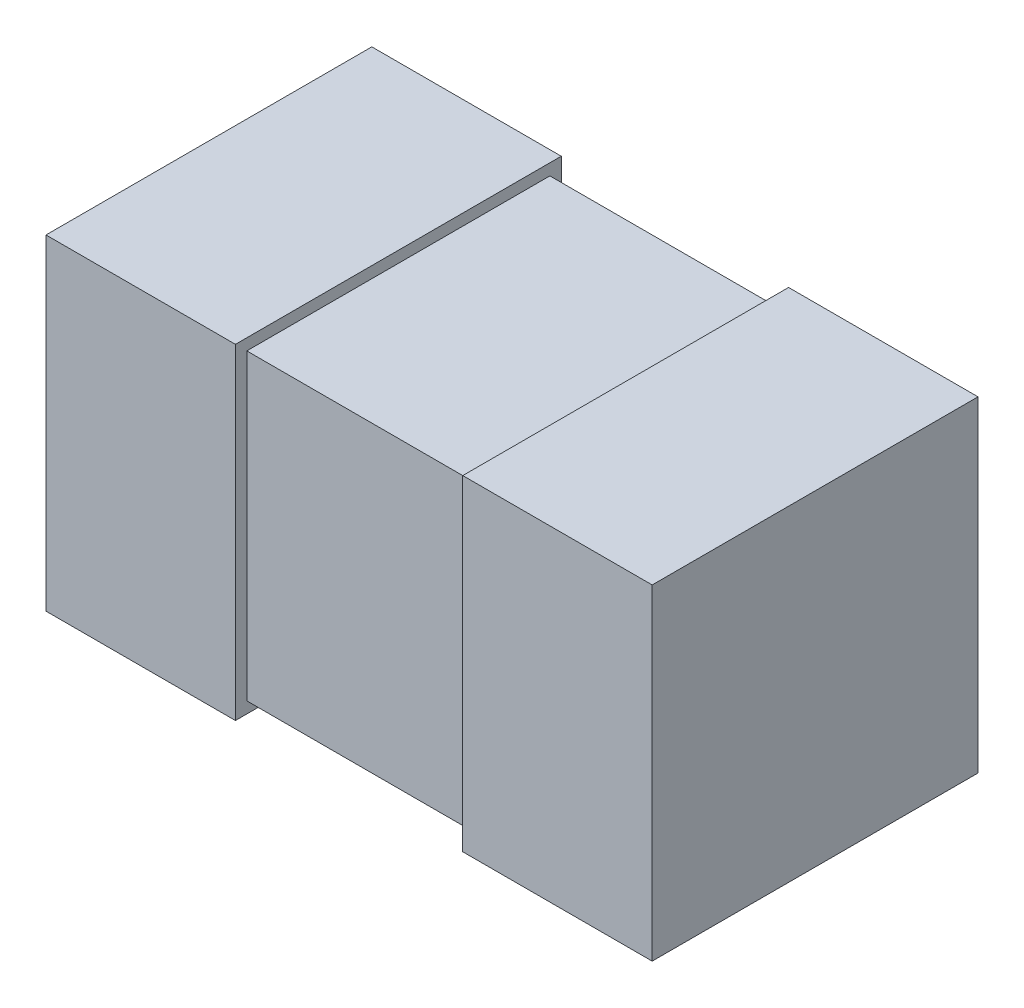
ISO-10303-21;
HEADER;
FILE_DESCRIPTION(('STEP AP214'),'2;1');
FILE_NAME('part.step','',(''),(''),'','','');
FILE_SCHEMA(('AUTOMOTIVE_DESIGN { 1 0 10303 214 1 1 1 1 }'));
ENDSEC;
DATA;
#1=APPLICATION_CONTEXT('core data for automotive mechanical design processes');
#2=APPLICATION_PROTOCOL_DEFINITION('international standard','automotive_design',2000,#1);
#3=PRODUCT_CONTEXT('',#1,'mechanical');
#4=PRODUCT('Part','Part','',(#3));
#5=PRODUCT_RELATED_PRODUCT_CATEGORY('part','',(#4));
#6=PRODUCT_DEFINITION_FORMATION('','',#4);
#7=PRODUCT_DEFINITION_CONTEXT('part definition',#1,'design');
#8=PRODUCT_DEFINITION('design','',#6,#7);
#9=PRODUCT_DEFINITION_SHAPE('','',#8);
#10=(LENGTH_UNIT() NAMED_UNIT(*) SI_UNIT(.MILLI.,.METRE.));
#11=(NAMED_UNIT(*) PLANE_ANGLE_UNIT() SI_UNIT($,.RADIAN.));
#12=(NAMED_UNIT(*) SI_UNIT($,.STERADIAN.) SOLID_ANGLE_UNIT());
#13=UNCERTAINTY_MEASURE_WITH_UNIT(LENGTH_MEASURE(1.E-05),#10,'distance_accuracy_value','');
#14=(GEOMETRIC_REPRESENTATION_CONTEXT(3) GLOBAL_UNCERTAINTY_ASSIGNED_CONTEXT((#13)) GLOBAL_UNIT_ASSIGNED_CONTEXT((#10,
#11,#12)) REPRESENTATION_CONTEXT('',''));
#15=CARTESIAN_POINT('',(0.,0.,0.));
#16=DIRECTION('',(0.,0.,1.));
#17=DIRECTION('',(1.,0.,0.));
#18=AXIS2_PLACEMENT_3D('',#15,#16,#17);
#19=CARTESIAN_POINT('',(-0.8,0.8,0.4));
#20=DIRECTION('',(0.,0.,-1.));
#21=DIRECTION('',(-1.,0.,0.));
#22=AXIS2_PLACEMENT_3D('',#19,#20,#21);
#23=PLANE('',#22);
#24=DIRECTION('',(0.,-1.,0.));
#25=VECTOR('',#24,1.);
#26=CARTESIAN_POINT('',(0.299999999999999,0.8,0.4));
#27=LINE('',#26,#25);
#28=CARTESIAN_POINT('',(0.299999999999999,0.8,0.4));
#29=VERTEX_POINT('',#28);
#30=CARTESIAN_POINT('',(0.299999999999999,0.,0.4));
#31=VERTEX_POINT('',#30);
#32=EDGE_CURVE('E32',#29,#31,#27,.T.);
#33=ORIENTED_EDGE('',*,*,#32,.F.);
#34=DIRECTION('',(1.,0.,0.));
#35=VECTOR('',#34,1.);
#36=CARTESIAN_POINT('',(-0.8,0.8,0.4));
#37=LINE('',#36,#35);
#38=CARTESIAN_POINT('',(-0.3,0.8,0.4));
#39=VERTEX_POINT('',#38);
#40=EDGE_CURVE('E197',#39,#29,#37,.T.);
#41=ORIENTED_EDGE('',*,*,#40,.F.);
#42=DIRECTION('',(0.,1.,0.));
#43=VECTOR('',#42,1.);
#44=CARTESIAN_POINT('',(-0.3,0.8,0.4));
#45=LINE('',#44,#43);
#46=CARTESIAN_POINT('',(-0.3,0.,0.4));
#47=VERTEX_POINT('',#46);
#48=EDGE_CURVE('E191',#47,#39,#45,.T.);
#49=ORIENTED_EDGE('',*,*,#48,.F.);
#50=DIRECTION('',(1.,0.,0.));
#51=VECTOR('',#50,1.);
#52=CARTESIAN_POINT('',(-0.8,0.,0.4));
#53=LINE('',#52,#51);
#54=EDGE_CURVE('E196',#47,#31,#53,.T.);
#55=ORIENTED_EDGE('',*,*,#54,.T.);
#56=EDGE_LOOP('',(#33,#41,#49,#55));
#57=FACE_BOUND('',#56,.T.);
#58=ADVANCED_FACE('F17',(#57),#23,.F.);
#59=CARTESIAN_POINT('',(-0.8,0.8,-0.4));
#60=DIRECTION('',(0.,0.,1.));
#61=DIRECTION('',(1.,0.,0.));
#62=AXIS2_PLACEMENT_3D('',#59,#60,#61);
#63=PLANE('',#62);
#64=DIRECTION('',(0.,1.,0.));
#65=VECTOR('',#64,1.);
#66=CARTESIAN_POINT('',(0.3,0.8,-0.4));
#67=LINE('',#66,#65);
#68=CARTESIAN_POINT('',(0.3,0.,-0.4));
#69=VERTEX_POINT('',#68);
#70=CARTESIAN_POINT('',(0.3,0.8,-0.4));
#71=VERTEX_POINT('',#70);
#72=EDGE_CURVE('E146',#69,#71,#67,.T.);
#73=ORIENTED_EDGE('',*,*,#72,.F.);
#74=DIRECTION('',(-1.,0.,0.));
#75=VECTOR('',#74,1.);
#76=CARTESIAN_POINT('',(-0.8,0.,-0.4));
#77=LINE('',#76,#75);
#78=CARTESIAN_POINT('',(-0.3,0.,-0.4));
#79=VERTEX_POINT('',#78);
#80=EDGE_CURVE('E200',#69,#79,#77,.T.);
#81=ORIENTED_EDGE('',*,*,#80,.T.);
#82=DIRECTION('',(0.,-1.,0.));
#83=VECTOR('',#82,1.);
#84=CARTESIAN_POINT('',(-0.3,0.8,-0.4));
#85=LINE('',#84,#83);
#86=CARTESIAN_POINT('',(-0.3,0.8,-0.4));
#87=VERTEX_POINT('',#86);
#88=EDGE_CURVE('E179',#87,#79,#85,.T.);
#89=ORIENTED_EDGE('',*,*,#88,.F.);
#90=DIRECTION('',(-1.,0.,0.));
#91=VECTOR('',#90,1.);
#92=CARTESIAN_POINT('',(-0.8,0.8,-0.4));
#93=LINE('',#92,#91);
#94=EDGE_CURVE('E199',#71,#87,#93,.T.);
#95=ORIENTED_EDGE('',*,*,#94,.F.);
#96=EDGE_LOOP('',(#73,#81,#89,#95));
#97=FACE_BOUND('',#96,.T.);
#98=ADVANCED_FACE('F217',(#97),#63,.F.);
#99=CARTESIAN_POINT('',(-0.8,0.8,0.4));
#100=DIRECTION('',(0.,1.,0.));
#101=DIRECTION('',(0.,0.,1.));
#102=AXIS2_PLACEMENT_3D('',#99,#100,#101);
#103=PLANE('',#102);
#104=ORIENTED_EDGE('',*,*,#40,.T.);
#105=DIRECTION('',(0.,0.,-1.));
#106=VECTOR('',#105,1.);
#107=CARTESIAN_POINT('',(0.3,0.8,0.4));
#108=LINE('',#107,#106);
#109=EDGE_CURVE('E39',#29,#71,#108,.T.);
#110=ORIENTED_EDGE('',*,*,#109,.T.);
#111=ORIENTED_EDGE('',*,*,#94,.T.);
#112=DIRECTION('',(0.,0.,1.));
#113=VECTOR('',#112,1.);
#114=CARTESIAN_POINT('',(-0.3,0.8,0.4));
#115=LINE('',#114,#113);
#116=EDGE_CURVE('E194',#87,#39,#115,.T.);
#117=ORIENTED_EDGE('',*,*,#116,.T.);
#118=EDGE_LOOP('',(#104,#110,#111,#117));
#119=FACE_BOUND('',#118,.T.);
#120=ADVANCED_FACE('F214',(#119),#103,.T.);
#121=CARTESIAN_POINT('',(-0.8,0.,0.4));
#122=DIRECTION('',(0.,1.,0.));
#123=DIRECTION('',(0.,0.,1.));
#124=AXIS2_PLACEMENT_3D('',#121,#122,#123);
#125=PLANE('',#124);
#126=DIRECTION('',(0.,0.,-1.));
#127=VECTOR('',#126,1.);
#128=CARTESIAN_POINT('',(0.3,0.,0.4));
#129=LINE('',#128,#127);
#130=EDGE_CURVE('E10',#31,#69,#129,.T.);
#131=ORIENTED_EDGE('',*,*,#130,.F.);
#132=ORIENTED_EDGE('',*,*,#54,.F.);
#133=DIRECTION('',(0.,0.,1.));
#134=VECTOR('',#133,1.);
#135=CARTESIAN_POINT('',(-0.3,0.,0.4));
#136=LINE('',#135,#134);
#137=EDGE_CURVE('E25',#79,#47,#136,.T.);
#138=ORIENTED_EDGE('',*,*,#137,.F.);
#139=ORIENTED_EDGE('',*,*,#80,.F.);
#140=EDGE_LOOP('',(#131,#132,#138,#139));
#141=FACE_BOUND('',#140,.T.);
#142=ADVANCED_FACE('F212',(#141),#125,.F.);
#143=CARTESIAN_POINT('',(-0.3,-0.03,1.45478640923567));
#144=DIRECTION('',(0.,1.,0.));
#145=DIRECTION('',(-1.,0.,0.));
#146=AXIS2_PLACEMENT_3D('',#143,#144,#145);
#147=PLANE('',#146);
#148=DIRECTION('',(0.,0.,-1.));
#149=VECTOR('',#148,1.);
#150=CARTESIAN_POINT('',(-0.3,-0.03,1.45478640923567));
#151=LINE('',#150,#149);
#152=CARTESIAN_POINT('',(-0.3,-0.03,0.43));
#153=VERTEX_POINT('',#152);
#154=CARTESIAN_POINT('',(-0.3,-0.03,-0.43));
#155=VERTEX_POINT('',#154);
#156=EDGE_CURVE('E168',#153,#155,#151,.T.);
#157=ORIENTED_EDGE('',*,*,#156,.F.);
#158=DIRECTION('',(-1.,0.,0.));
#159=VECTOR('',#158,1.);
#160=CARTESIAN_POINT('',(-0.3,-0.03,0.43));
#161=LINE('',#160,#159);
#162=CARTESIAN_POINT('',(-0.8,-0.03,0.43));
#163=VERTEX_POINT('',#162);
#164=EDGE_CURVE('E173',#153,#163,#161,.T.);
#165=ORIENTED_EDGE('',*,*,#164,.T.);
#166=DIRECTION('',(0.,0.,-1.));
#167=VECTOR('',#166,1.);
#168=CARTESIAN_POINT('',(-0.8,-0.03,1.45478640923567));
#169=LINE('',#168,#167);
#170=CARTESIAN_POINT('',(-0.8,-0.03,-0.43));
#171=VERTEX_POINT('',#170);
#172=EDGE_CURVE('E181',#163,#171,#169,.T.);
#173=ORIENTED_EDGE('',*,*,#172,.T.);
#174=DIRECTION('',(-1.,0.,0.));
#175=VECTOR('',#174,1.);
#176=CARTESIAN_POINT('',(-0.3,-0.03,-0.43));
#177=LINE('',#176,#175);
#178=EDGE_CURVE('E159',#155,#171,#177,.T.);
#179=ORIENTED_EDGE('',*,*,#178,.F.);
#180=EDGE_LOOP('',(#157,#165,#173,#179));
#181=FACE_BOUND('',#180,.T.);
#182=ADVANCED_FACE('F259',(#181),#147,.F.);
#183=CARTESIAN_POINT('',(-0.3,0.83,1.45478640923567));
#184=DIRECTION('',(0.,-1.,0.));
#185=DIRECTION('',(1.,0.,0.));
#186=AXIS2_PLACEMENT_3D('',#183,#184,#185);
#187=PLANE('',#186);
#188=DIRECTION('',(0.,0.,-1.));
#189=VECTOR('',#188,1.);
#190=CARTESIAN_POINT('',(-0.8,0.83,1.45478640923567));
#191=LINE('',#190,#189);
#192=CARTESIAN_POINT('',(-0.8,0.83,0.43));
#193=VERTEX_POINT('',#192);
#194=CARTESIAN_POINT('',(-0.8,0.83,-0.43));
#195=VERTEX_POINT('',#194);
#196=EDGE_CURVE('E183',#193,#195,#191,.T.);
#197=ORIENTED_EDGE('',*,*,#196,.F.);
#198=DIRECTION('',(1.,0.,0.));
#199=VECTOR('',#198,1.);
#200=CARTESIAN_POINT('',(-0.3,0.83,0.43));
#201=LINE('',#200,#199);
#202=CARTESIAN_POINT('',(-0.3,0.83,0.43));
#203=VERTEX_POINT('',#202);
#204=EDGE_CURVE('E172',#193,#203,#201,.T.);
#205=ORIENTED_EDGE('',*,*,#204,.T.);
#206=DIRECTION('',(0.,0.,-1.));
#207=VECTOR('',#206,1.);
#208=CARTESIAN_POINT('',(-0.3,0.83,1.45478640923567));
#209=LINE('',#208,#207);
#210=CARTESIAN_POINT('',(-0.3,0.83,-0.43));
#211=VERTEX_POINT('',#210);
#212=EDGE_CURVE('E185',#203,#211,#209,.T.);
#213=ORIENTED_EDGE('',*,*,#212,.T.);
#214=DIRECTION('',(1.,0.,0.));
#215=VECTOR('',#214,1.);
#216=CARTESIAN_POINT('',(-0.3,0.83,-0.43));
#217=LINE('',#216,#215);
#218=EDGE_CURVE('E165',#195,#211,#217,.T.);
#219=ORIENTED_EDGE('',*,*,#218,.F.);
#220=EDGE_LOOP('',(#197,#205,#213,#219));
#221=FACE_BOUND('',#220,.T.);
#222=ADVANCED_FACE('F262',(#221),#187,.F.);
#223=CARTESIAN_POINT('',(-0.3,0.83,1.45478640923567));
#224=DIRECTION('',(-1.,0.,0.));
#225=DIRECTION('',(0.,-1.,0.));
#226=AXIS2_PLACEMENT_3D('',#223,#224,#225);
#227=PLANE('',#226);
#228=ORIENTED_EDGE('',*,*,#116,.F.);
#229=ORIENTED_EDGE('',*,*,#88,.T.);
#230=ORIENTED_EDGE('',*,*,#137,.T.);
#231=ORIENTED_EDGE('',*,*,#48,.T.);
#232=EDGE_LOOP('',(#228,#229,#230,#231));
#233=FACE_BOUND('',#232,.T.);
#234=ORIENTED_EDGE('',*,*,#212,.F.);
#235=DIRECTION('',(0.,-1.,0.));
#236=VECTOR('',#235,1.);
#237=CARTESIAN_POINT('',(-0.3,0.83,0.43));
#238=LINE('',#237,#236);
#239=EDGE_CURVE('E176',#203,#153,#238,.T.);
#240=ORIENTED_EDGE('',*,*,#239,.T.);
#241=ORIENTED_EDGE('',*,*,#156,.T.);
#242=DIRECTION('',(0.,-1.,0.));
#243=VECTOR('',#242,1.);
#244=CARTESIAN_POINT('',(-0.3,0.83,-0.43));
#245=LINE('',#244,#243);
#246=EDGE_CURVE('E162',#211,#155,#245,.T.);
#247=ORIENTED_EDGE('',*,*,#246,.F.);
#248=EDGE_LOOP('',(#234,#240,#241,#247));
#249=FACE_BOUND('',#248,.T.);
#250=ADVANCED_FACE('F207',(#233,#249),#227,.F.);
#251=CARTESIAN_POINT('',(-0.8,0.8,0.43));
#252=DIRECTION('',(0.,0.,-1.));
#253=DIRECTION('',(-1.,0.,0.));
#254=AXIS2_PLACEMENT_3D('',#251,#252,#253);
#255=PLANE('',#254);
#256=ORIENTED_EDGE('',*,*,#204,.F.);
#257=DIRECTION('',(0.,1.,0.));
#258=VECTOR('',#257,1.);
#259=CARTESIAN_POINT('',(-0.8,0.83,0.43));
#260=LINE('',#259,#258);
#261=EDGE_CURVE('E169',#163,#193,#260,.T.);
#262=ORIENTED_EDGE('',*,*,#261,.F.);
#263=ORIENTED_EDGE('',*,*,#164,.F.);
#264=ORIENTED_EDGE('',*,*,#239,.F.);
#265=EDGE_LOOP('',(#256,#262,#263,#264));
#266=FACE_BOUND('',#265,.T.);
#267=ADVANCED_FACE('F254',(#266),#255,.F.);
#268=CARTESIAN_POINT('',(-0.8,0.8,-0.43));
#269=DIRECTION('',(0.,0.,1.));
#270=DIRECTION('',(1.,0.,0.));
#271=AXIS2_PLACEMENT_3D('',#268,#269,#270);
#272=PLANE('',#271);
#273=ORIENTED_EDGE('',*,*,#246,.T.);
#274=ORIENTED_EDGE('',*,*,#178,.T.);
#275=DIRECTION('',(0.,1.,0.));
#276=VECTOR('',#275,1.);
#277=CARTESIAN_POINT('',(-0.8,0.83,-0.43));
#278=LINE('',#277,#276);
#279=EDGE_CURVE('E156',#171,#195,#278,.T.);
#280=ORIENTED_EDGE('',*,*,#279,.T.);
#281=ORIENTED_EDGE('',*,*,#218,.T.);
#282=EDGE_LOOP('',(#273,#274,#280,#281));
#283=FACE_BOUND('',#282,.T.);
#284=ADVANCED_FACE('F251',(#283),#272,.F.);
#285=CARTESIAN_POINT('',(-0.8,0.8,-0.4));
#286=DIRECTION('',(1.,0.,0.));
#287=DIRECTION('',(0.,0.,-1.));
#288=AXIS2_PLACEMENT_3D('',#285,#286,#287);
#289=PLANE('',#288);
#290=ORIENTED_EDGE('',*,*,#172,.F.);
#291=ORIENTED_EDGE('',*,*,#261,.T.);
#292=ORIENTED_EDGE('',*,*,#196,.T.);
#293=ORIENTED_EDGE('',*,*,#279,.F.);
#294=EDGE_LOOP('',(#290,#291,#292,#293));
#295=FACE_BOUND('',#294,.T.);
#296=ADVANCED_FACE('F19',(#295),#289,.F.);
#297=CARTESIAN_POINT('',(0.3,-0.0299999999999999,1.45478640923567));
#298=DIRECTION('',(0.,1.,0.));
#299=DIRECTION('',(-1.,0.,0.));
#300=AXIS2_PLACEMENT_3D('',#297,#298,#299);
#301=PLANE('',#300);
#302=DIRECTION('',(0.,0.,-1.));
#303=VECTOR('',#302,1.);
#304=CARTESIAN_POINT('',(0.8,-0.0299999999999998,1.45478640923567));
#305=LINE('',#304,#303);
#306=CARTESIAN_POINT('',(0.8,-0.0299999999999998,0.43));
#307=VERTEX_POINT('',#306);
#308=CARTESIAN_POINT('',(0.8,-0.0299999999999998,-0.43));
#309=VERTEX_POINT('',#308);
#310=EDGE_CURVE('E119',#307,#309,#305,.T.);
#311=ORIENTED_EDGE('',*,*,#310,.F.);
#312=DIRECTION('',(-1.,0.,0.));
#313=VECTOR('',#312,1.);
#314=CARTESIAN_POINT('',(0.3,-0.0299999999999999,0.43));
#315=LINE('',#314,#313);
#316=CARTESIAN_POINT('',(0.3,-0.0299999999999999,0.43));
#317=VERTEX_POINT('',#316);
#318=EDGE_CURVE('E114',#307,#317,#315,.T.);
#319=ORIENTED_EDGE('',*,*,#318,.T.);
#320=DIRECTION('',(0.,0.,-1.));
#321=VECTOR('',#320,1.);
#322=CARTESIAN_POINT('',(0.3,-0.0299999999999999,1.45478640923567));
#323=LINE('',#322,#321);
#324=CARTESIAN_POINT('',(0.3,-0.0299999999999999,-0.43));
#325=VERTEX_POINT('',#324);
#326=EDGE_CURVE('E109',#317,#325,#323,.T.);
#327=ORIENTED_EDGE('',*,*,#326,.T.);
#328=DIRECTION('',(-1.,0.,0.));
#329=VECTOR('',#328,1.);
#330=CARTESIAN_POINT('',(0.3,-0.0299999999999999,-0.43));
#331=LINE('',#330,#329);
#332=EDGE_CURVE('E113',#309,#325,#331,.T.);
#333=ORIENTED_EDGE('',*,*,#332,.F.);
#334=EDGE_LOOP('',(#311,#319,#327,#333));
#335=FACE_BOUND('',#334,.T.);
#336=ADVANCED_FACE('F112',(#335),#301,.F.);
#337=CARTESIAN_POINT('',(0.3,0.83,1.45478640923567));
#338=DIRECTION('',(1.,0.,0.));
#339=DIRECTION('',(0.,0.,-1.));
#340=AXIS2_PLACEMENT_3D('',#337,#338,#339);
#341=PLANE('',#340);
#342=ORIENTED_EDGE('',*,*,#109,.F.);
#343=ORIENTED_EDGE('',*,*,#32,.T.);
#344=ORIENTED_EDGE('',*,*,#130,.T.);
#345=ORIENTED_EDGE('',*,*,#72,.T.);
#346=EDGE_LOOP('',(#342,#343,#344,#345));
#347=FACE_BOUND('',#346,.T.);
#348=ORIENTED_EDGE('',*,*,#326,.F.);
#349=DIRECTION('',(0.,1.,0.));
#350=VECTOR('',#349,1.);
#351=CARTESIAN_POINT('',(0.3,0.83,0.43));
#352=LINE('',#351,#350);
#353=CARTESIAN_POINT('',(0.3,0.83,0.43));
#354=VERTEX_POINT('',#353);
#355=EDGE_CURVE('E141',#317,#354,#352,.T.);
#356=ORIENTED_EDGE('',*,*,#355,.T.);
#357=DIRECTION('',(0.,0.,-1.));
#358=VECTOR('',#357,1.);
#359=CARTESIAN_POINT('',(0.3,0.83,1.45478640923567));
#360=LINE('',#359,#358);
#361=CARTESIAN_POINT('',(0.3,0.83,-0.43));
#362=VERTEX_POINT('',#361);
#363=EDGE_CURVE('E118',#354,#362,#360,.T.);
#364=ORIENTED_EDGE('',*,*,#363,.T.);
#365=DIRECTION('',(0.,1.,0.));
#366=VECTOR('',#365,1.);
#367=CARTESIAN_POINT('',(0.3,0.83,-0.43));
#368=LINE('',#367,#366);
#369=EDGE_CURVE('E126',#325,#362,#368,.T.);
#370=ORIENTED_EDGE('',*,*,#369,.F.);
#371=EDGE_LOOP('',(#348,#356,#364,#370));
#372=FACE_BOUND('',#371,.T.);
#373=ADVANCED_FACE('F131',(#347,#372),#341,.F.);
#374=CARTESIAN_POINT('',(0.3,0.83,1.45478640923567));
#375=DIRECTION('',(0.,-1.,0.));
#376=DIRECTION('',(0.,0.,-1.));
#377=AXIS2_PLACEMENT_3D('',#374,#375,#376);
#378=PLANE('',#377);
#379=ORIENTED_EDGE('',*,*,#363,.F.);
#380=DIRECTION('',(1.,0.,0.));
#381=VECTOR('',#380,1.);
#382=CARTESIAN_POINT('',(0.3,0.83,0.43));
#383=LINE('',#382,#381);
#384=CARTESIAN_POINT('',(0.8,0.83,0.43));
#385=VERTEX_POINT('',#384);
#386=EDGE_CURVE('E144',#354,#385,#383,.T.);
#387=ORIENTED_EDGE('',*,*,#386,.T.);
#388=DIRECTION('',(0.,0.,-1.));
#389=VECTOR('',#388,1.);
#390=CARTESIAN_POINT('',(0.8,0.83,1.45478640923567));
#391=LINE('',#390,#389);
#392=CARTESIAN_POINT('',(0.8,0.83,-0.43));
#393=VERTEX_POINT('',#392);
#394=EDGE_CURVE('E133',#385,#393,#391,.T.);
#395=ORIENTED_EDGE('',*,*,#394,.T.);
#396=DIRECTION('',(1.,0.,0.));
#397=VECTOR('',#396,1.);
#398=CARTESIAN_POINT('',(0.3,0.83,-0.43));
#399=LINE('',#398,#397);
#400=EDGE_CURVE('E134',#362,#393,#399,.T.);
#401=ORIENTED_EDGE('',*,*,#400,.F.);
#402=EDGE_LOOP('',(#379,#387,#395,#401));
#403=FACE_BOUND('',#402,.T.);
#404=ADVANCED_FACE('F238',(#403),#378,.F.);
#405=CARTESIAN_POINT('',(-0.8,0.8,0.43));
#406=DIRECTION('',(0.,0.,-1.));
#407=DIRECTION('',(-1.,0.,0.));
#408=AXIS2_PLACEMENT_3D('',#405,#406,#407);
#409=PLANE('',#408);
#410=ORIENTED_EDGE('',*,*,#355,.F.);
#411=ORIENTED_EDGE('',*,*,#318,.F.);
#412=DIRECTION('',(0.,-1.,0.));
#413=VECTOR('',#412,1.);
#414=CARTESIAN_POINT('',(0.8,0.83,0.43));
#415=LINE('',#414,#413);
#416=EDGE_CURVE('E142',#385,#307,#415,.T.);
#417=ORIENTED_EDGE('',*,*,#416,.F.);
#418=ORIENTED_EDGE('',*,*,#386,.F.);
#419=EDGE_LOOP('',(#410,#411,#417,#418));
#420=FACE_BOUND('',#419,.T.);
#421=ADVANCED_FACE('F234',(#420),#409,.F.);
#422=CARTESIAN_POINT('',(-0.8,0.8,-0.43));
#423=DIRECTION('',(0.,0.,1.));
#424=DIRECTION('',(1.,0.,0.));
#425=AXIS2_PLACEMENT_3D('',#422,#423,#424);
#426=PLANE('',#425);
#427=ORIENTED_EDGE('',*,*,#400,.T.);
#428=DIRECTION('',(0.,-1.,0.));
#429=VECTOR('',#428,1.);
#430=CARTESIAN_POINT('',(0.8,0.83,-0.43));
#431=LINE('',#430,#429);
#432=EDGE_CURVE('E129',#393,#309,#431,.T.);
#433=ORIENTED_EDGE('',*,*,#432,.T.);
#434=ORIENTED_EDGE('',*,*,#332,.T.);
#435=ORIENTED_EDGE('',*,*,#369,.T.);
#436=EDGE_LOOP('',(#427,#433,#434,#435));
#437=FACE_BOUND('',#436,.T.);
#438=ADVANCED_FACE('F125',(#437),#426,.F.);
#439=CARTESIAN_POINT('',(0.8,0.8,-0.4));
#440=DIRECTION('',(-1.,0.,0.));
#441=DIRECTION('',(0.,0.,1.));
#442=AXIS2_PLACEMENT_3D('',#439,#440,#441);
#443=PLANE('',#442);
#444=ORIENTED_EDGE('',*,*,#394,.F.);
#445=ORIENTED_EDGE('',*,*,#416,.T.);
#446=ORIENTED_EDGE('',*,*,#310,.T.);
#447=ORIENTED_EDGE('',*,*,#432,.F.);
#448=EDGE_LOOP('',(#444,#445,#446,#447));
#449=FACE_BOUND('',#448,.T.);
#450=ADVANCED_FACE('F228',(#449),#443,.F.);
#451=CLOSED_SHELL('',(#58,#98,#120,#142,#182,#222,#250,#267,#284,#296,#336,#373,#404,#421,#438,#450));
#452=MANIFOLD_SOLID_BREP('B1',#451);
#453=ADVANCED_BREP_SHAPE_REPRESENTATION('',(#18,#452),#14);
#454=SHAPE_DEFINITION_REPRESENTATION(#9,#453);
ENDSEC;
END-ISO-10303-21;
